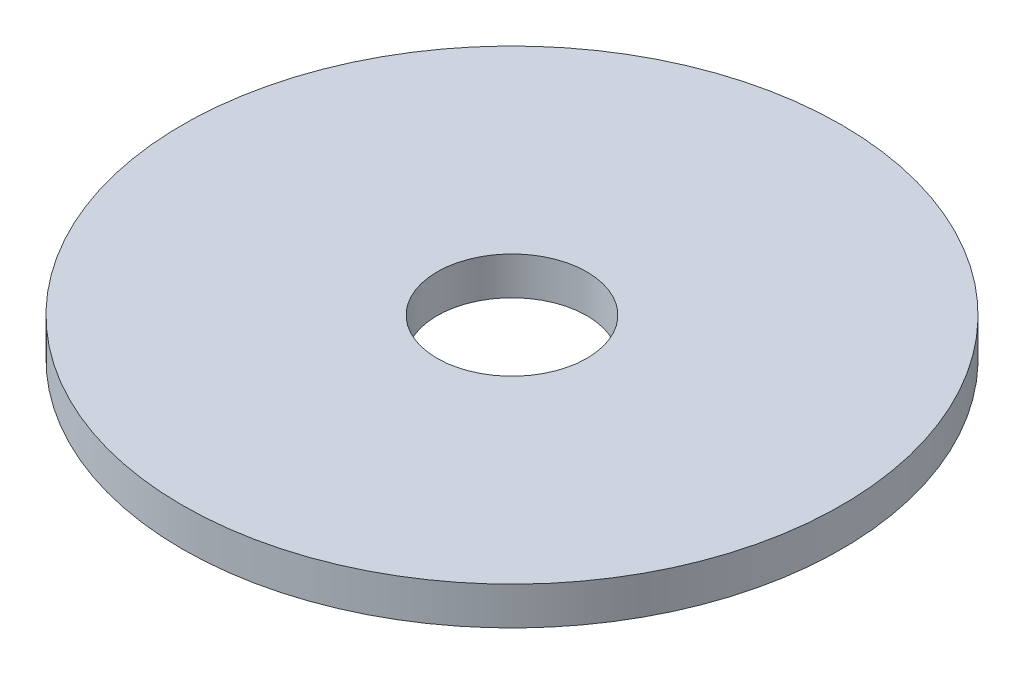
ISO-10303-21;
HEADER;
FILE_DESCRIPTION(('STEP AP214'),'2;1');
FILE_NAME('part.step','',(''),(''),'','','');
FILE_SCHEMA(('AUTOMOTIVE_DESIGN { 1 0 10303 214 1 1 1 1 }'));
ENDSEC;
DATA;
#1=APPLICATION_CONTEXT('core data for automotive mechanical design processes');
#2=APPLICATION_PROTOCOL_DEFINITION('international standard','automotive_design',2000,#1);
#3=PRODUCT_CONTEXT('',#1,'mechanical');
#4=PRODUCT('Part','Part','',(#3));
#5=PRODUCT_RELATED_PRODUCT_CATEGORY('part','',(#4));
#6=PRODUCT_DEFINITION_FORMATION('','',#4);
#7=PRODUCT_DEFINITION_CONTEXT('part definition',#1,'design');
#8=PRODUCT_DEFINITION('design','',#6,#7);
#9=PRODUCT_DEFINITION_SHAPE('','',#8);
#10=(LENGTH_UNIT() NAMED_UNIT(*) SI_UNIT(.MILLI.,.METRE.));
#11=(NAMED_UNIT(*) PLANE_ANGLE_UNIT() SI_UNIT($,.RADIAN.));
#12=(NAMED_UNIT(*) SI_UNIT($,.STERADIAN.) SOLID_ANGLE_UNIT());
#13=UNCERTAINTY_MEASURE_WITH_UNIT(LENGTH_MEASURE(1.E-05),#10,'distance_accuracy_value','');
#14=(GEOMETRIC_REPRESENTATION_CONTEXT(3) GLOBAL_UNCERTAINTY_ASSIGNED_CONTEXT((#13)) GLOBAL_UNIT_ASSIGNED_CONTEXT((#10,
#11,#12)) REPRESENTATION_CONTEXT('',''));
#15=CARTESIAN_POINT('',(0.,0.,0.));
#16=DIRECTION('',(0.,0.,1.));
#17=DIRECTION('',(1.,0.,0.));
#18=AXIS2_PLACEMENT_3D('',#15,#16,#17);
#19=CARTESIAN_POINT('',(0.,4.826,0.));
#20=DIRECTION('',(0.,-1.,0.));
#21=DIRECTION('',(0.,0.,-1.));
#22=AXIS2_PLACEMENT_3D('',#19,#20,#21);
#23=CYLINDRICAL_SURFACE('',#22,83.82);
#24=CARTESIAN_POINT('',(0.,4.826,0.));
#25=DIRECTION('',(0.,1.,0.));
#26=DIRECTION('',(0.,0.,1.));
#27=AXIS2_PLACEMENT_3D('',#24,#25,#26);
#28=CIRCLE('',#27,83.82);
#29=CARTESIAN_POINT('',(0.,4.826,83.82));
#30=VERTEX_POINT('',#29);
#31=EDGE_CURVE('E10',#30,#30,#28,.T.);
#32=ORIENTED_EDGE('',*,*,#31,.F.);
#33=EDGE_LOOP('',(#32));
#34=FACE_BOUND('',#33,.T.);
#35=CARTESIAN_POINT('',(0.,-4.826,0.));
#36=DIRECTION('',(0.,1.,0.));
#37=DIRECTION('',(0.,0.,1.));
#38=AXIS2_PLACEMENT_3D('',#35,#36,#37);
#39=CIRCLE('',#38,83.82);
#40=CARTESIAN_POINT('',(0.,-4.826,83.82));
#41=VERTEX_POINT('',#40);
#42=EDGE_CURVE('E35',#41,#41,#39,.T.);
#43=ORIENTED_EDGE('',*,*,#42,.T.);
#44=EDGE_LOOP('',(#43));
#45=FACE_BOUND('',#44,.T.);
#46=ADVANCED_FACE('F32',(#34,#45),#23,.T.);
#47=CARTESIAN_POINT('',(0.,4.826,0.));
#48=DIRECTION('',(0.,1.,0.));
#49=DIRECTION('',(0.,0.,1.));
#50=AXIS2_PLACEMENT_3D('',#47,#48,#49);
#51=PLANE('',#50);
#52=CARTESIAN_POINT('',(0.,4.826,0.));
#53=DIRECTION('',(0.,1.,0.));
#54=DIRECTION('',(0.,0.,1.));
#55=AXIS2_PLACEMENT_3D('',#52,#53,#54);
#56=CIRCLE('',#55,19.05);
#57=CARTESIAN_POINT('',(0.,4.826,19.05));
#58=VERTEX_POINT('',#57);
#59=EDGE_CURVE('E42',#58,#58,#56,.F.);
#60=ORIENTED_EDGE('',*,*,#59,.T.);
#61=EDGE_LOOP('',(#60));
#62=FACE_BOUND('',#61,.T.);
#63=ORIENTED_EDGE('',*,*,#31,.T.);
#64=EDGE_LOOP('',(#63));
#65=FACE_BOUND('',#64,.T.);
#66=ADVANCED_FACE('F56',(#62,#65),#51,.T.);
#67=CARTESIAN_POINT('',(0.,-4.826,0.));
#68=DIRECTION('',(0.,1.,0.));
#69=DIRECTION('',(0.,0.,1.));
#70=AXIS2_PLACEMENT_3D('',#67,#68,#69);
#71=PLANE('',#70);
#72=CARTESIAN_POINT('',(0.,-4.826,0.));
#73=DIRECTION('',(0.,-1.,0.));
#74=DIRECTION('',(0.,0.,-1.));
#75=AXIS2_PLACEMENT_3D('',#72,#73,#74);
#76=CIRCLE('',#75,19.05);
#77=CARTESIAN_POINT('',(0.,-4.826,-19.05));
#78=VERTEX_POINT('',#77);
#79=EDGE_CURVE('E46',#78,#78,#76,.T.);
#80=ORIENTED_EDGE('',*,*,#79,.F.);
#81=EDGE_LOOP('',(#80));
#82=FACE_BOUND('',#81,.T.);
#83=ORIENTED_EDGE('',*,*,#42,.F.);
#84=EDGE_LOOP('',(#83));
#85=FACE_BOUND('',#84,.T.);
#86=ADVANCED_FACE('F53',(#82,#85),#71,.F.);
#87=CARTESIAN_POINT('',(0.,58.7075367264149,0.));
#88=DIRECTION('',(0.,-1.,0.));
#89=DIRECTION('',(0.,0.,-1.));
#90=AXIS2_PLACEMENT_3D('',#87,#88,#89);
#91=CYLINDRICAL_SURFACE('',#90,19.05);
#92=ORIENTED_EDGE('',*,*,#79,.T.);
#93=EDGE_LOOP('',(#92));
#94=FACE_BOUND('',#93,.T.);
#95=ORIENTED_EDGE('',*,*,#59,.F.);
#96=EDGE_LOOP('',(#95));
#97=FACE_BOUND('',#96,.T.);
#98=ADVANCED_FACE('F50',(#94,#97),#91,.F.);
#99=CLOSED_SHELL('',(#46,#66,#86,#98));
#100=MANIFOLD_SOLID_BREP('B2',#99);
#101=ADVANCED_BREP_SHAPE_REPRESENTATION('',(#18,#100),#14);
#102=SHAPE_DEFINITION_REPRESENTATION(#9,#101);
ENDSEC;
END-ISO-10303-21;
